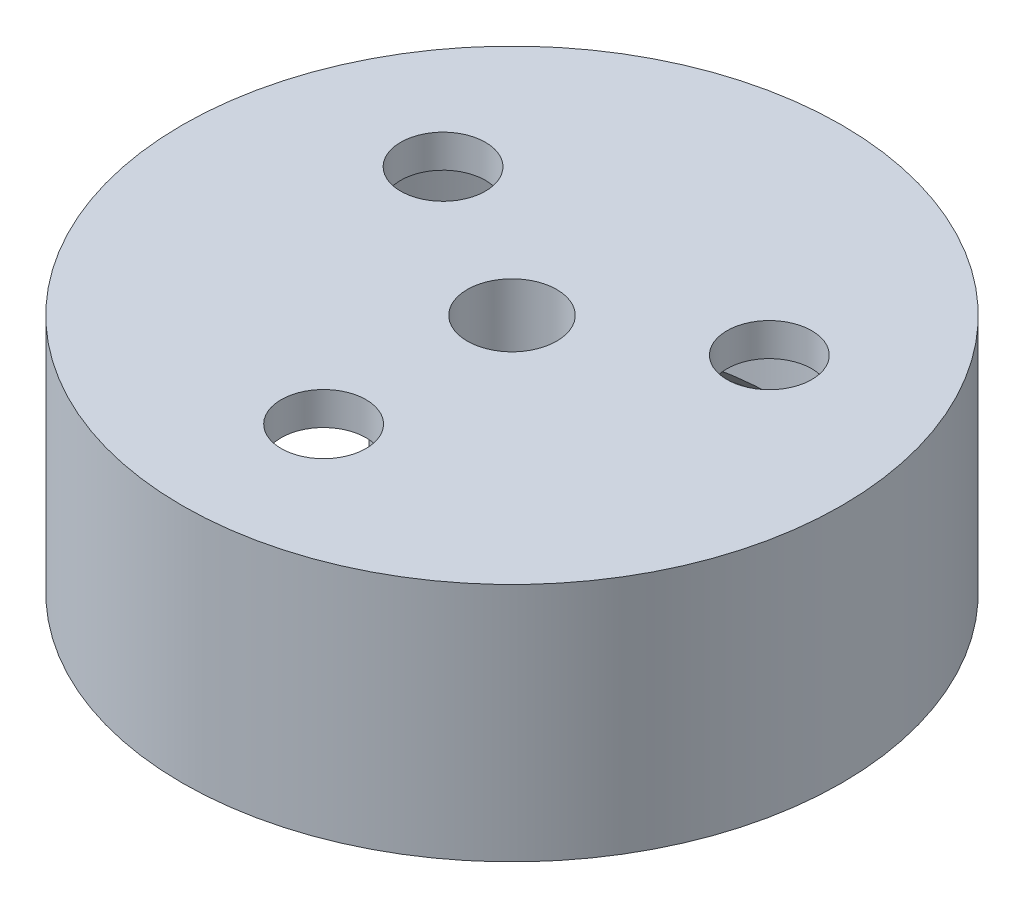
ISO-10303-21;
HEADER;
FILE_DESCRIPTION(('STEP AP214'),'2;1');
FILE_NAME('part.step','',(''),(''),'','','');
FILE_SCHEMA(('AUTOMOTIVE_DESIGN { 1 0 10303 214 1 1 1 1 }'));
ENDSEC;
DATA;
#1=APPLICATION_CONTEXT('core data for automotive mechanical design processes');
#2=APPLICATION_PROTOCOL_DEFINITION('international standard','automotive_design',2000,#1);
#3=PRODUCT_CONTEXT('',#1,'mechanical');
#4=PRODUCT('Part','Part','',(#3));
#5=PRODUCT_RELATED_PRODUCT_CATEGORY('part','',(#4));
#6=PRODUCT_DEFINITION_FORMATION('','',#4);
#7=PRODUCT_DEFINITION_CONTEXT('part definition',#1,'design');
#8=PRODUCT_DEFINITION('design','',#6,#7);
#9=PRODUCT_DEFINITION_SHAPE('','',#8);
#10=(LENGTH_UNIT() NAMED_UNIT(*) SI_UNIT(.MILLI.,.METRE.));
#11=(NAMED_UNIT(*) PLANE_ANGLE_UNIT() SI_UNIT($,.RADIAN.));
#12=(NAMED_UNIT(*) SI_UNIT($,.STERADIAN.) SOLID_ANGLE_UNIT());
#13=UNCERTAINTY_MEASURE_WITH_UNIT(LENGTH_MEASURE(1.E-05),#10,'distance_accuracy_value','');
#14=(GEOMETRIC_REPRESENTATION_CONTEXT(3) GLOBAL_UNCERTAINTY_ASSIGNED_CONTEXT((#13)) GLOBAL_UNIT_ASSIGNED_CONTEXT((#10,
#11,#12)) REPRESENTATION_CONTEXT('',''));
#15=CARTESIAN_POINT('',(0.,0.,0.));
#16=DIRECTION('',(0.,0.,1.));
#17=DIRECTION('',(1.,0.,0.));
#18=AXIS2_PLACEMENT_3D('',#15,#16,#17);
#19=CARTESIAN_POINT('',(0.,0.,0.));
#20=DIRECTION('',(0.,1.,0.));
#21=DIRECTION('',(0.,0.,1.));
#22=AXIS2_PLACEMENT_3D('',#19,#20,#21);
#23=PLANE('',#22);
#24=CARTESIAN_POINT('',(0.,0.,0.));
#25=DIRECTION('',(0.,1.,0.));
#26=DIRECTION('',(0.,0.,1.));
#27=AXIS2_PLACEMENT_3D('',#24,#25,#26);
#28=CIRCLE('',#27,1.35);
#29=CARTESIAN_POINT('',(0.,0.,1.35));
#30=VERTEX_POINT('',#29);
#31=EDGE_CURVE('E193',#30,#30,#28,.F.);
#32=ORIENTED_EDGE('',*,*,#31,.T.);
#33=EDGE_LOOP('',(#32));
#34=FACE_BOUND('',#33,.T.);
#35=CARTESIAN_POINT('',(0.,0.,0.));
#36=DIRECTION('',(0.,-1.,0.));
#37=DIRECTION('',(0.,0.,-1.));
#38=AXIS2_PLACEMENT_3D('',#35,#36,#37);
#39=CIRCLE('',#38,0.95);
#40=CARTESIAN_POINT('',(0.,0.,-0.95));
#41=VERTEX_POINT('',#40);
#42=EDGE_CURVE('E181',#41,#41,#39,.T.);
#43=ORIENTED_EDGE('',*,*,#42,.F.);
#44=EDGE_LOOP('',(#43));
#45=FACE_BOUND('',#44,.T.);
#46=ADVANCED_FACE('F44',(#34,#45),#23,.F.);
#47=CARTESIAN_POINT('',(0.,5.1,0.));
#48=DIRECTION('',(0.,-1.,0.));
#49=DIRECTION('',(0.,0.,-1.));
#50=AXIS2_PLACEMENT_3D('',#47,#48,#49);
#51=CYLINDRICAL_SURFACE('',#50,7.);
#52=CARTESIAN_POINT('',(0.,5.1,0.));
#53=DIRECTION('',(0.,1.,0.));
#54=DIRECTION('',(0.,0.,1.));
#55=AXIS2_PLACEMENT_3D('',#52,#53,#54);
#56=CIRCLE('',#55,7.);
#57=CARTESIAN_POINT('',(0.,5.1,7.));
#58=VERTEX_POINT('',#57);
#59=EDGE_CURVE('E189',#58,#58,#56,.T.);
#60=ORIENTED_EDGE('',*,*,#59,.F.);
#61=EDGE_LOOP('',(#60));
#62=FACE_BOUND('',#61,.T.);
#63=CARTESIAN_POINT('',(0.,0.,0.));
#64=DIRECTION('',(0.,1.,0.));
#65=DIRECTION('',(0.,0.,1.));
#66=AXIS2_PLACEMENT_3D('',#63,#64,#65);
#67=CIRCLE('',#66,7.);
#68=CARTESIAN_POINT('',(0.,0.,7.));
#69=VERTEX_POINT('',#68);
#70=EDGE_CURVE('E188',#69,#69,#67,.T.);
#71=ORIENTED_EDGE('',*,*,#70,.T.);
#72=EDGE_LOOP('',(#71));
#73=FACE_BOUND('',#72,.T.);
#74=ADVANCED_FACE('F319',(#62,#73),#51,.T.);
#75=CARTESIAN_POINT('',(0.,5.1,0.));
#76=DIRECTION('',(0.,1.,0.));
#77=DIRECTION('',(0.,0.,1.));
#78=AXIS2_PLACEMENT_3D('',#75,#76,#77);
#79=PLANE('',#78);
#80=CARTESIAN_POINT('',(0.,5.1,4.));
#81=DIRECTION('',(0.,-1.,0.));
#82=DIRECTION('',(0.,0.,-1.));
#83=AXIS2_PLACEMENT_3D('',#80,#81,#82);
#84=CIRCLE('',#83,0.9);
#85=CARTESIAN_POINT('',(0.,5.1,3.1));
#86=VERTEX_POINT('',#85);
#87=EDGE_CURVE('E248',#86,#86,#84,.T.);
#88=ORIENTED_EDGE('',*,*,#87,.T.);
#89=EDGE_LOOP('',(#88));
#90=FACE_BOUND('',#89,.T.);
#91=CARTESIAN_POINT('',(3.46410161513801,5.1,-1.99999999999985));
#92=DIRECTION('',(0.,-1.,0.));
#93=DIRECTION('',(0.,0.,-1.));
#94=AXIS2_PLACEMENT_3D('',#91,#92,#93);
#95=CIRCLE('',#94,0.900000000000222);
#96=CARTESIAN_POINT('',(3.46410161513801,5.1,-2.90000000000007));
#97=VERTEX_POINT('',#96);
#98=EDGE_CURVE('E290',#97,#97,#95,.T.);
#99=ORIENTED_EDGE('',*,*,#98,.T.);
#100=EDGE_LOOP('',(#99));
#101=FACE_BOUND('',#100,.T.);
#102=CARTESIAN_POINT('',(-3.4641016151375,5.1,-2.00000000000015));
#103=DIRECTION('',(0.,-1.,0.));
#104=DIRECTION('',(0.,0.,-1.));
#105=AXIS2_PLACEMENT_3D('',#102,#103,#104);
#106=CIRCLE('',#105,0.900000000000323);
#107=CARTESIAN_POINT('',(-3.4641016151375,5.1,-2.90000000000047));
#108=VERTEX_POINT('',#107);
#109=EDGE_CURVE('E286',#108,#108,#106,.T.);
#110=ORIENTED_EDGE('',*,*,#109,.T.);
#111=EDGE_LOOP('',(#110));
#112=FACE_BOUND('',#111,.T.);
#113=CARTESIAN_POINT('',(0.,5.1,0.));
#114=DIRECTION('',(0.,1.,0.));
#115=DIRECTION('',(0.,0.,1.));
#116=AXIS2_PLACEMENT_3D('',#113,#114,#115);
#117=CIRCLE('',#116,0.95);
#118=CARTESIAN_POINT('',(0.,5.1,0.95));
#119=VERTEX_POINT('',#118);
#120=EDGE_CURVE('E184',#119,#119,#117,.T.);
#121=ORIENTED_EDGE('',*,*,#120,.F.);
#122=EDGE_LOOP('',(#121));
#123=FACE_BOUND('',#122,.T.);
#124=ORIENTED_EDGE('',*,*,#59,.T.);
#125=EDGE_LOOP('',(#124));
#126=FACE_BOUND('',#125,.T.);
#127=ADVANCED_FACE('F300',(#90,#101,#112,#123,#126),#79,.T.);
#128=DIRECTION('',(0.,0.,1.));
#129=VECTOR('',#128,1.);
#130=CARTESIAN_POINT('',(1.85,0.,6.3));
#131=LINE('',#130,#129);
#132=CARTESIAN_POINT('',(1.85,0.,6.12678545405338));
#133=VERTEX_POINT('',#132);
#134=CARTESIAN_POINT('',(1.85,0.,6.3));
#135=VERTEX_POINT('',#134);
#136=EDGE_CURVE('E143',#133,#135,#131,.T.);
#137=ORIENTED_EDGE('',*,*,#136,.F.);
#138=CARTESIAN_POINT('',(0.,0.,0.));
#139=DIRECTION('',(0.,1.,0.));
#140=DIRECTION('',(0.,0.,1.));
#141=AXIS2_PLACEMENT_3D('',#138,#139,#140);
#142=CIRCLE('',#141,6.40000000000001);
#143=CARTESIAN_POINT('',(-1.85,0.,6.12678545405338));
#144=VERTEX_POINT('',#143);
#145=EDGE_CURVE('E71',#133,#144,#142,.T.);
#146=ORIENTED_EDGE('',*,*,#145,.T.);
#147=DIRECTION('',(0.,0.,-1.));
#148=VECTOR('',#147,1.);
#149=CARTESIAN_POINT('',(-1.85,0.,6.3));
#150=LINE('',#149,#148);
#151=CARTESIAN_POINT('',(-1.85,0.,6.3));
#152=VERTEX_POINT('',#151);
#153=EDGE_CURVE('E153',#152,#144,#150,.T.);
#154=ORIENTED_EDGE('',*,*,#153,.F.);
#155=DIRECTION('',(-1.,0.,0.));
#156=VECTOR('',#155,1.);
#157=CARTESIAN_POINT('',(-1.85,0.,6.3));
#158=LINE('',#157,#156);
#159=EDGE_CURVE('E135',#135,#152,#158,.T.);
#160=ORIENTED_EDGE('',*,*,#159,.F.);
#161=EDGE_LOOP('',(#137,#146,#154,#160));
#162=FACE_BOUND('',#161,.T.);
#163=ORIENTED_EDGE('',*,*,#70,.F.);
#164=EDGE_LOOP('',(#163));
#165=FACE_BOUND('',#164,.T.);
#166=ADVANCED_FACE('F322',(#162,#165),#23,.F.);
#167=CARTESIAN_POINT('',(0.,8.,0.));
#168=DIRECTION('',(0.,-1.,0.));
#169=DIRECTION('',(0.,0.,-1.));
#170=AXIS2_PLACEMENT_3D('',#167,#168,#169);
#171=CYLINDRICAL_SURFACE('',#170,0.95);
#172=ORIENTED_EDGE('',*,*,#120,.T.);
#173=EDGE_LOOP('',(#172));
#174=FACE_BOUND('',#173,.T.);
#175=ORIENTED_EDGE('',*,*,#42,.T.);
#176=EDGE_LOOP('',(#175));
#177=FACE_BOUND('',#176,.T.);
#178=ADVANCED_FACE('F331',(#174,#177),#171,.F.);
#179=CARTESIAN_POINT('',(0.,4.,0.));
#180=DIRECTION('',(0.,-1.,0.));
#181=DIRECTION('',(0.,0.,-1.));
#182=AXIS2_PLACEMENT_3D('',#179,#180,#181);
#183=CYLINDRICAL_SURFACE('',#182,5.6);
#184=DIRECTION('',(0.,-1.,0.));
#185=VECTOR('',#184,1.);
#186=CARTESIAN_POINT('',(-1.05356537528527,4.,5.5));
#187=LINE('',#186,#185);
#188=CARTESIAN_POINT('',(-1.05356537528527,4.,5.5));
#189=VERTEX_POINT('',#188);
#190=CARTESIAN_POINT('',(-1.05356537528527,0.800000000000001,5.5));
#191=VERTEX_POINT('',#190);
#192=EDGE_CURVE('E122',#189,#191,#187,.T.);
#193=ORIENTED_EDGE('',*,*,#192,.T.);
#194=CARTESIAN_POINT('',(0.,0.800000000000001,0.));
#195=DIRECTION('',(0.,1.,0.));
#196=DIRECTION('',(0.,0.,1.));
#197=AXIS2_PLACEMENT_3D('',#194,#195,#196);
#198=CIRCLE('',#197,5.6);
#199=CARTESIAN_POINT('',(1.05356537528527,0.800000000000001,5.5));
#200=VERTEX_POINT('',#199);
#201=EDGE_CURVE('E203',#191,#200,#198,.F.);
#202=ORIENTED_EDGE('',*,*,#201,.T.);
#203=DIRECTION('',(0.,-1.,0.));
#204=VECTOR('',#203,1.);
#205=CARTESIAN_POINT('',(1.05356537528527,4.,5.5));
#206=LINE('',#205,#204);
#207=CARTESIAN_POINT('',(1.05356537528527,4.,5.5));
#208=VERTEX_POINT('',#207);
#209=EDGE_CURVE('E171',#200,#208,#206,.F.);
#210=ORIENTED_EDGE('',*,*,#209,.T.);
#211=CARTESIAN_POINT('',(0.,4.,0.));
#212=DIRECTION('',(0.,-1.,0.));
#213=DIRECTION('',(0.,0.,-1.));
#214=AXIS2_PLACEMENT_3D('',#211,#212,#213);
#215=CIRCLE('',#214,5.6);
#216=EDGE_CURVE('E178',#189,#208,#215,.T.);
#217=ORIENTED_EDGE('',*,*,#216,.F.);
#218=EDGE_LOOP('',(#193,#202,#210,#217));
#219=FACE_BOUND('',#218,.T.);
#220=ADVANCED_FACE('F336',(#219),#183,.F.);
#221=CARTESIAN_POINT('',(0.,4.,0.));
#222=DIRECTION('',(0.,-1.,0.));
#223=DIRECTION('',(0.,0.,-1.));
#224=AXIS2_PLACEMENT_3D('',#221,#222,#223);
#225=PLANE('',#224);
#226=CARTESIAN_POINT('',(0.,4.,4.));
#227=DIRECTION('',(0.,-1.,0.));
#228=DIRECTION('',(0.,0.,-1.));
#229=AXIS2_PLACEMENT_3D('',#226,#227,#228);
#230=CIRCLE('',#229,1.5);
#231=CARTESIAN_POINT('',(0.,4.,2.5));
#232=VERTEX_POINT('',#231);
#233=EDGE_CURVE('E279',#232,#232,#230,.T.);
#234=ORIENTED_EDGE('',*,*,#233,.F.);
#235=EDGE_LOOP('',(#234));
#236=FACE_BOUND('',#235,.T.);
#237=CARTESIAN_POINT('',(3.46410161513801,4.,-1.99999999999985));
#238=DIRECTION('',(0.,-1.,0.));
#239=DIRECTION('',(0.,0.,-1.));
#240=AXIS2_PLACEMENT_3D('',#237,#238,#239);
#241=CIRCLE('',#240,1.50000000000022);
#242=CARTESIAN_POINT('',(3.46410161513801,4.,-3.50000000000007));
#243=VERTEX_POINT('',#242);
#244=EDGE_CURVE('E268',#243,#243,#241,.T.);
#245=ORIENTED_EDGE('',*,*,#244,.F.);
#246=EDGE_LOOP('',(#245));
#247=FACE_BOUND('',#246,.T.);
#248=CARTESIAN_POINT('',(-3.4641016151375,4.,-2.00000000000015));
#249=DIRECTION('',(0.,-1.,0.));
#250=DIRECTION('',(0.,0.,-1.));
#251=AXIS2_PLACEMENT_3D('',#248,#249,#250);
#252=CIRCLE('',#251,1.50000000000032);
#253=CARTESIAN_POINT('',(-3.4641016151375,4.,-3.50000000000047));
#254=VERTEX_POINT('',#253);
#255=EDGE_CURVE('E146',#254,#254,#252,.T.);
#256=ORIENTED_EDGE('',*,*,#255,.F.);
#257=EDGE_LOOP('',(#256));
#258=FACE_BOUND('',#257,.T.);
#259=ORIENTED_EDGE('',*,*,#216,.T.);
#260=DIRECTION('',(1.,0.,0.));
#261=VECTOR('',#260,1.);
#262=CARTESIAN_POINT('',(-1.85,4.,5.5));
#263=LINE('',#262,#261);
#264=CARTESIAN_POINT('',(1.85,4.,5.5));
#265=VERTEX_POINT('',#264);
#266=EDGE_CURVE('E128',#208,#265,#263,.T.);
#267=ORIENTED_EDGE('',*,*,#266,.T.);
#268=DIRECTION('',(0.,0.,1.));
#269=VECTOR('',#268,1.);
#270=CARTESIAN_POINT('',(1.85,4.,6.3));
#271=LINE('',#270,#269);
#272=CARTESIAN_POINT('',(1.85,4.,6.3));
#273=VERTEX_POINT('',#272);
#274=EDGE_CURVE('E127',#265,#273,#271,.T.);
#275=ORIENTED_EDGE('',*,*,#274,.T.);
#276=DIRECTION('',(-1.,0.,0.));
#277=VECTOR('',#276,1.);
#278=CARTESIAN_POINT('',(-1.85,4.,6.3));
#279=LINE('',#278,#277);
#280=CARTESIAN_POINT('',(-1.85,4.,6.3));
#281=VERTEX_POINT('',#280);
#282=EDGE_CURVE('E116',#273,#281,#279,.T.);
#283=ORIENTED_EDGE('',*,*,#282,.T.);
#284=DIRECTION('',(0.,0.,-1.));
#285=VECTOR('',#284,1.);
#286=CARTESIAN_POINT('',(-1.85,4.,6.3));
#287=LINE('',#286,#285);
#288=CARTESIAN_POINT('',(-1.85,4.,5.5));
#289=VERTEX_POINT('',#288);
#290=EDGE_CURVE('E110',#281,#289,#287,.T.);
#291=ORIENTED_EDGE('',*,*,#290,.T.);
#292=EDGE_CURVE('E119',#289,#189,#263,.T.);
#293=ORIENTED_EDGE('',*,*,#292,.T.);
#294=EDGE_LOOP('',(#259,#267,#275,#283,#291,#293));
#295=FACE_BOUND('',#294,.T.);
#296=CARTESIAN_POINT('',(0.,4.,0.));
#297=DIRECTION('',(0.,-1.,0.));
#298=DIRECTION('',(0.,0.,-1.));
#299=AXIS2_PLACEMENT_3D('',#296,#297,#298);
#300=CIRCLE('',#299,2.15);
#301=CARTESIAN_POINT('',(0.,4.,-2.15));
#302=VERTEX_POINT('',#301);
#303=EDGE_CURVE('E174',#302,#302,#300,.T.);
#304=ORIENTED_EDGE('',*,*,#303,.F.);
#305=EDGE_LOOP('',(#304));
#306=FACE_BOUND('',#305,.T.);
#307=ADVANCED_FACE('F130',(#236,#247,#258,#295,#306),#225,.T.);
#308=CARTESIAN_POINT('',(0.,4.,0.));
#309=DIRECTION('',(0.,-1.,0.));
#310=DIRECTION('',(0.,0.,-1.));
#311=AXIS2_PLACEMENT_3D('',#308,#309,#310);
#312=CYLINDRICAL_SURFACE('',#311,2.15);
#313=CARTESIAN_POINT('',(0.,0.800000000000005,0.));
#314=DIRECTION('',(0.,1.,0.));
#315=DIRECTION('',(0.,0.,1.));
#316=AXIS2_PLACEMENT_3D('',#313,#314,#315);
#317=CIRCLE('',#316,2.15);
#318=CARTESIAN_POINT('',(0.,0.800000000000005,2.15));
#319=VERTEX_POINT('',#318);
#320=EDGE_CURVE('E199',#319,#319,#317,.T.);
#321=ORIENTED_EDGE('',*,*,#320,.T.);
#322=EDGE_LOOP('',(#321));
#323=FACE_BOUND('',#322,.T.);
#324=ORIENTED_EDGE('',*,*,#303,.T.);
#325=EDGE_LOOP('',(#324));
#326=FACE_BOUND('',#325,.T.);
#327=ADVANCED_FACE('F226',(#323,#326),#312,.T.);
#328=CARTESIAN_POINT('',(-1.85,4.,5.5));
#329=DIRECTION('',(0.,0.,-1.));
#330=DIRECTION('',(-1.,0.,0.));
#331=AXIS2_PLACEMENT_3D('',#328,#329,#330);
#332=PLANE('',#331);
#333=ORIENTED_EDGE('',*,*,#209,.F.);
#334=CARTESIAN_POINT('',(1.05356537528527,0.800000000000001,5.5));
#335=CARTESIAN_POINT('',(1.12095042340882,0.787324164126497,5.5));
#336=CARTESIAN_POINT('',(1.18811827355289,0.773512442889198,5.5));
#337=CARTESIAN_POINT('',(1.32191171231927,0.743746289491473,5.5));
#338=CARTESIAN_POINT('',(1.38853775183271,0.727793886367867,5.5));
#339=CARTESIAN_POINT('',(1.5212629280321,0.693852102762216,5.5));
#340=CARTESIAN_POINT('',(1.5873620946295,0.675862838810607,5.5));
#341=CARTESIAN_POINT('',(1.71907126000181,0.637949738237488,5.5));
#342=CARTESIAN_POINT('',(1.78468073923725,0.618024094934847,5.5));
#343=CARTESIAN_POINT('',(1.85,0.597198952230056,5.5));
#344=B_SPLINE_CURVE_WITH_KNOTS('',3,(#334,#335,#336,#337,#338,#339,#340,#341,#342,#343),
.UNSPECIFIED.,.F.,.F.,(4,2,2,2,4),(0.,0.205686044840459,0.411178490190537,0.616659185088118,
0.822333472714189),.UNSPECIFIED.);
#345=CARTESIAN_POINT('',(1.85,0.597198952230054,5.5));
#346=VERTEX_POINT('',#345);
#347=EDGE_CURVE('E207',#200,#346,#344,.T.);
#348=ORIENTED_EDGE('',*,*,#347,.T.);
#349=DIRECTION('',(0.,-1.,0.));
#350=VECTOR('',#349,1.);
#351=CARTESIAN_POINT('',(1.85,4.,5.5));
#352=LINE('',#351,#350);
#353=EDGE_CURVE('E115',#265,#346,#352,.T.);
#354=ORIENTED_EDGE('',*,*,#353,.F.);
#355=ORIENTED_EDGE('',*,*,#266,.F.);
#356=EDGE_LOOP('',(#333,#348,#354,#355));
#357=FACE_BOUND('',#356,.T.);
#358=ADVANCED_FACE('F222',(#357),#332,.F.);
#359=DIRECTION('',(0.,-1.,0.));
#360=VECTOR('',#359,1.);
#361=CARTESIAN_POINT('',(-1.85,4.,5.5));
#362=LINE('',#361,#360);
#363=CARTESIAN_POINT('',(-1.85,0.597198952230054,5.5));
#364=VERTEX_POINT('',#363);
#365=EDGE_CURVE('E106',#289,#364,#362,.T.);
#366=ORIENTED_EDGE('',*,*,#365,.T.);
#367=CARTESIAN_POINT('',(-1.85,0.597198952230055,5.5));
#368=CARTESIAN_POINT('',(-1.78468073923725,0.618024094934846,5.5));
#369=CARTESIAN_POINT('',(-1.71907126000181,0.637949738237486,5.5));
#370=CARTESIAN_POINT('',(-1.5873620946295,0.675862838810606,5.5));
#371=CARTESIAN_POINT('',(-1.5212629280321,0.693852102762216,5.5));
#372=CARTESIAN_POINT('',(-1.38853775183272,0.727793886367867,5.5));
#373=CARTESIAN_POINT('',(-1.32191171231927,0.743746289491473,5.5));
#374=CARTESIAN_POINT('',(-1.18811827355289,0.773512442889198,5.5));
#375=CARTESIAN_POINT('',(-1.12095042340882,0.787324164126497,5.5));
#376=CARTESIAN_POINT('',(-1.05356537528527,0.800000000000001,5.5));
#377=B_SPLINE_CURVE_WITH_KNOTS('',3,(#367,#368,#369,#370,#371,#372,#373,#374,#375,#376),
.UNSPECIFIED.,.F.,.F.,(4,2,2,2,4),(0.,0.205674287626071,0.411154982523652,0.61664742787373,
0.822333472714189),.UNSPECIFIED.);
#378=EDGE_CURVE('E11',#364,#191,#377,.T.);
#379=ORIENTED_EDGE('',*,*,#378,.T.);
#380=ORIENTED_EDGE('',*,*,#192,.F.);
#381=ORIENTED_EDGE('',*,*,#292,.F.);
#382=EDGE_LOOP('',(#366,#379,#380,#381));
#383=FACE_BOUND('',#382,.T.);
#384=ADVANCED_FACE('F120',(#383),#332,.F.);
#385=CARTESIAN_POINT('',(-1.85,4.,6.3));
#386=DIRECTION('',(-1.,0.,0.));
#387=DIRECTION('',(0.,0.,1.));
#388=AXIS2_PLACEMENT_3D('',#385,#386,#387);
#389=PLANE('',#388);
#390=ORIENTED_EDGE('',*,*,#153,.T.);
#391=CARTESIAN_POINT('',(-1.85,0.,6.12678545405338));
#392=CARTESIAN_POINT('',(-1.85,0.0997924033278603,6.02256823408604));
#393=CARTESIAN_POINT('',(-1.85,0.199455180603481,5.91822750687696));
#394=CARTESIAN_POINT('',(-1.85,0.398521498052575,5.70929902222973));
#395=CARTESIAN_POINT('',(-1.85,0.497925038186973,5.60471126475435));
#396=CARTESIAN_POINT('',(-1.85,0.597198952230055,5.5));
#397=B_SPLINE_CURVE_WITH_KNOTS('',3,(#391,#392,#393,#394,#395,#396),.UNSPECIFIED.,.F.,.F.,(4,2,
4),(0.,0.432870545035451,0.865741155316185),.UNSPECIFIED.);
#398=EDGE_CURVE('E56',#144,#364,#397,.T.);
#399=ORIENTED_EDGE('',*,*,#398,.T.);
#400=ORIENTED_EDGE('',*,*,#365,.F.);
#401=ORIENTED_EDGE('',*,*,#290,.F.);
#402=DIRECTION('',(0.,-1.,0.));
#403=VECTOR('',#402,1.);
#404=CARTESIAN_POINT('',(-1.85,4.,6.3));
#405=LINE('',#404,#403);
#406=EDGE_CURVE('E159',#281,#152,#405,.T.);
#407=ORIENTED_EDGE('',*,*,#406,.T.);
#408=EDGE_LOOP('',(#390,#399,#400,#401,#407));
#409=FACE_BOUND('',#408,.T.);
#410=ADVANCED_FACE('F108',(#409),#389,.F.);
#411=CARTESIAN_POINT('',(-1.85,4.,6.3));
#412=DIRECTION('',(0.,0.,1.));
#413=DIRECTION('',(1.,0.,0.));
#414=AXIS2_PLACEMENT_3D('',#411,#412,#413);
#415=PLANE('',#414);
#416=ORIENTED_EDGE('',*,*,#159,.T.);
#417=ORIENTED_EDGE('',*,*,#406,.F.);
#418=ORIENTED_EDGE('',*,*,#282,.F.);
#419=DIRECTION('',(0.,-1.,0.));
#420=VECTOR('',#419,1.);
#421=CARTESIAN_POINT('',(1.85,4.,6.3));
#422=LINE('',#421,#420);
#423=EDGE_CURVE('E162',#273,#135,#422,.T.);
#424=ORIENTED_EDGE('',*,*,#423,.T.);
#425=EDGE_LOOP('',(#416,#417,#418,#424));
#426=FACE_BOUND('',#425,.T.);
#427=ADVANCED_FACE('F357',(#426),#415,.F.);
#428=CARTESIAN_POINT('',(1.85,4.,6.3));
#429=DIRECTION('',(1.,0.,0.));
#430=DIRECTION('',(0.,0.,-1.));
#431=AXIS2_PLACEMENT_3D('',#428,#429,#430);
#432=PLANE('',#431);
#433=ORIENTED_EDGE('',*,*,#353,.T.);
#434=CARTESIAN_POINT('',(1.85,0.597198952230055,5.5));
#435=CARTESIAN_POINT('',(1.85,0.497925038186973,5.60471126475435));
#436=CARTESIAN_POINT('',(1.85,0.398521498052575,5.70929902222973));
#437=CARTESIAN_POINT('',(1.85,0.199455180603481,5.91822750687696));
#438=CARTESIAN_POINT('',(1.85,0.0997924033278605,6.02256823408604));
#439=CARTESIAN_POINT('',(1.85,0.,6.12678545405338));
#440=B_SPLINE_CURVE_WITH_KNOTS('',3,(#434,#435,#436,#437,#438,#439),.UNSPECIFIED.,.F.,.F.,(4,2,
4),(0.,0.432870610280734,0.865741155316184),.UNSPECIFIED.);
#441=EDGE_CURVE('E215',#346,#133,#440,.T.);
#442=ORIENTED_EDGE('',*,*,#441,.T.);
#443=ORIENTED_EDGE('',*,*,#136,.T.);
#444=ORIENTED_EDGE('',*,*,#423,.F.);
#445=ORIENTED_EDGE('',*,*,#274,.F.);
#446=EDGE_LOOP('',(#433,#442,#443,#444,#445));
#447=FACE_BOUND('',#446,.T.);
#448=ADVANCED_FACE('F228',(#447),#432,.F.);
#449=CARTESIAN_POINT('',(0.,0.,0.));
#450=DIRECTION('',(0.,1.,0.));
#451=DIRECTION('',(0.,0.,1.));
#452=AXIS2_PLACEMENT_3D('',#449,#450,#451);
#453=CONICAL_SURFACE('',#452,1.35,0.785398163397447);
#454=ORIENTED_EDGE('',*,*,#320,.F.);
#455=EDGE_LOOP('',(#454));
#456=FACE_BOUND('',#455,.T.);
#457=ORIENTED_EDGE('',*,*,#31,.F.);
#458=EDGE_LOOP('',(#457));
#459=FACE_BOUND('',#458,.T.);
#460=ADVANCED_FACE('F363',(#456,#459),#453,.T.);
#461=CARTESIAN_POINT('',(0.,0.800000000000001,0.));
#462=DIRECTION('',(0.,-1.,0.));
#463=DIRECTION('',(0.,0.,-1.));
#464=AXIS2_PLACEMENT_3D('',#461,#462,#463);
#465=CONICAL_SURFACE('',#464,5.6,0.785398163397451);
#466=ORIENTED_EDGE('',*,*,#398,.F.);
#467=ORIENTED_EDGE('',*,*,#145,.F.);
#468=ORIENTED_EDGE('',*,*,#441,.F.);
#469=ORIENTED_EDGE('',*,*,#347,.F.);
#470=ORIENTED_EDGE('',*,*,#201,.F.);
#471=ORIENTED_EDGE('',*,*,#378,.F.);
#472=EDGE_LOOP('',(#466,#467,#468,#469,#470,#471));
#473=FACE_BOUND('',#472,.T.);
#474=ADVANCED_FACE('F47',(#473),#465,.F.);
#475=CARTESIAN_POINT('',(-3.4641016151375,4.4,-2.00000000000015));
#476=DIRECTION('',(0.,-1.,0.));
#477=DIRECTION('',(0.,0.,-1.));
#478=AXIS2_PLACEMENT_3D('',#475,#476,#477);
#479=CYLINDRICAL_SURFACE('',#478,1.50000000000032);
#480=CARTESIAN_POINT('',(-3.4641016151375,4.4,-2.00000000000015));
#481=DIRECTION('',(0.,-1.,0.));
#482=DIRECTION('',(0.,0.,-1.));
#483=AXIS2_PLACEMENT_3D('',#480,#481,#482);
#484=CIRCLE('',#483,1.50000000000032);
#485=CARTESIAN_POINT('',(-3.4641016151375,4.4,-3.50000000000047));
#486=VERTEX_POINT('',#485);
#487=EDGE_CURVE('E261',#486,#486,#484,.T.);
#488=ORIENTED_EDGE('',*,*,#487,.F.);
#489=EDGE_LOOP('',(#488));
#490=FACE_BOUND('',#489,.T.);
#491=ORIENTED_EDGE('',*,*,#255,.T.);
#492=EDGE_LOOP('',(#491));
#493=FACE_BOUND('',#492,.T.);
#494=ADVANCED_FACE('F365',(#490,#493),#479,.F.);
#495=CARTESIAN_POINT('',(-3.4641016151375,4.4,-2.00000000000015));
#496=DIRECTION('',(0.,-1.,0.));
#497=DIRECTION('',(0.,0.,-1.));
#498=AXIS2_PLACEMENT_3D('',#495,#496,#497);
#499=PLANE('',#498);
#500=CARTESIAN_POINT('',(-3.4641016151375,4.4,-2.00000000000015));
#501=DIRECTION('',(0.,-1.,0.));
#502=DIRECTION('',(0.,0.,-1.));
#503=AXIS2_PLACEMENT_3D('',#500,#501,#502);
#504=CIRCLE('',#503,0.900000000000323);
#505=CARTESIAN_POINT('',(-3.4641016151375,4.4,-2.90000000000047));
#506=VERTEX_POINT('',#505);
#507=EDGE_CURVE('E50',#506,#506,#504,.T.);
#508=ORIENTED_EDGE('',*,*,#507,.F.);
#509=EDGE_LOOP('',(#508));
#510=FACE_BOUND('',#509,.T.);
#511=ORIENTED_EDGE('',*,*,#487,.T.);
#512=EDGE_LOOP('',(#511));
#513=FACE_BOUND('',#512,.T.);
#514=ADVANCED_FACE('F368',(#510,#513),#499,.T.);
#515=CARTESIAN_POINT('',(3.46410161513801,4.4,-1.99999999999985));
#516=DIRECTION('',(0.,-1.,0.));
#517=DIRECTION('',(0.,0.,-1.));
#518=AXIS2_PLACEMENT_3D('',#515,#516,#517);
#519=CYLINDRICAL_SURFACE('',#518,1.50000000000022);
#520=CARTESIAN_POINT('',(3.46410161513801,4.4,-1.99999999999985));
#521=DIRECTION('',(0.,-1.,0.));
#522=DIRECTION('',(0.,0.,-1.));
#523=AXIS2_PLACEMENT_3D('',#520,#521,#522);
#524=CIRCLE('',#523,1.50000000000022);
#525=CARTESIAN_POINT('',(3.46410161513801,4.4,-3.50000000000007));
#526=VERTEX_POINT('',#525);
#527=EDGE_CURVE('E273',#526,#526,#524,.T.);
#528=ORIENTED_EDGE('',*,*,#527,.F.);
#529=EDGE_LOOP('',(#528));
#530=FACE_BOUND('',#529,.T.);
#531=ORIENTED_EDGE('',*,*,#244,.T.);
#532=EDGE_LOOP('',(#531));
#533=FACE_BOUND('',#532,.T.);
#534=ADVANCED_FACE('F372',(#530,#533),#519,.F.);
#535=CARTESIAN_POINT('',(3.46410161513801,4.4,-1.99999999999985));
#536=DIRECTION('',(0.,-1.,0.));
#537=DIRECTION('',(0.,0.,-1.));
#538=AXIS2_PLACEMENT_3D('',#535,#536,#537);
#539=PLANE('',#538);
#540=CARTESIAN_POINT('',(3.46410161513801,4.4,-1.99999999999985));
#541=DIRECTION('',(0.,-1.,0.));
#542=DIRECTION('',(0.,0.,-1.));
#543=AXIS2_PLACEMENT_3D('',#540,#541,#542);
#544=CIRCLE('',#543,0.900000000000222);
#545=CARTESIAN_POINT('',(3.46410161513801,4.4,-2.90000000000007));
#546=VERTEX_POINT('',#545);
#547=EDGE_CURVE('E247',#546,#546,#544,.T.);
#548=ORIENTED_EDGE('',*,*,#547,.F.);
#549=EDGE_LOOP('',(#548));
#550=FACE_BOUND('',#549,.T.);
#551=ORIENTED_EDGE('',*,*,#527,.T.);
#552=EDGE_LOOP('',(#551));
#553=FACE_BOUND('',#552,.T.);
#554=ADVANCED_FACE('F376',(#550,#553),#539,.T.);
#555=CARTESIAN_POINT('',(0.,4.4,4.));
#556=DIRECTION('',(0.,-1.,0.));
#557=DIRECTION('',(0.,0.,-1.));
#558=AXIS2_PLACEMENT_3D('',#555,#556,#557);
#559=CYLINDRICAL_SURFACE('',#558,1.5);
#560=CARTESIAN_POINT('',(0.,4.4,4.));
#561=DIRECTION('',(0.,-1.,0.));
#562=DIRECTION('',(0.,0.,-1.));
#563=AXIS2_PLACEMENT_3D('',#560,#561,#562);
#564=CIRCLE('',#563,1.5);
#565=CARTESIAN_POINT('',(0.,4.4,2.5));
#566=VERTEX_POINT('',#565);
#567=EDGE_CURVE('E156',#566,#566,#564,.T.);
#568=ORIENTED_EDGE('',*,*,#567,.F.);
#569=EDGE_LOOP('',(#568));
#570=FACE_BOUND('',#569,.T.);
#571=ORIENTED_EDGE('',*,*,#233,.T.);
#572=EDGE_LOOP('',(#571));
#573=FACE_BOUND('',#572,.T.);
#574=ADVANCED_FACE('F315',(#570,#573),#559,.F.);
#575=CARTESIAN_POINT('',(0.,4.4,4.));
#576=DIRECTION('',(0.,-1.,0.));
#577=DIRECTION('',(0.,0.,-1.));
#578=AXIS2_PLACEMENT_3D('',#575,#576,#577);
#579=PLANE('',#578);
#580=CARTESIAN_POINT('',(0.,4.4,4.));
#581=DIRECTION('',(0.,-1.,0.));
#582=DIRECTION('',(0.,0.,-1.));
#583=AXIS2_PLACEMENT_3D('',#580,#581,#582);
#584=CIRCLE('',#583,0.9);
#585=CARTESIAN_POINT('',(0.,4.4,3.1));
#586=VERTEX_POINT('',#585);
#587=EDGE_CURVE('E244',#586,#586,#584,.T.);
#588=ORIENTED_EDGE('',*,*,#587,.F.);
#589=EDGE_LOOP('',(#588));
#590=FACE_BOUND('',#589,.T.);
#591=ORIENTED_EDGE('',*,*,#567,.T.);
#592=EDGE_LOOP('',(#591));
#593=FACE_BOUND('',#592,.T.);
#594=ADVANCED_FACE('F306',(#590,#593),#579,.T.);
#595=CARTESIAN_POINT('',(0.,5.1,4.));
#596=DIRECTION('',(0.,-1.,0.));
#597=DIRECTION('',(0.,0.,-1.));
#598=AXIS2_PLACEMENT_3D('',#595,#596,#597);
#599=CYLINDRICAL_SURFACE('',#598,0.9);
#600=ORIENTED_EDGE('',*,*,#587,.T.);
#601=EDGE_LOOP('',(#600));
#602=FACE_BOUND('',#601,.T.);
#603=ORIENTED_EDGE('',*,*,#87,.F.);
#604=EDGE_LOOP('',(#603));
#605=FACE_BOUND('',#604,.T.);
#606=ADVANCED_FACE('F303',(#602,#605),#599,.F.);
#607=CARTESIAN_POINT('',(3.46410161513801,5.1,-1.99999999999985));
#608=DIRECTION('',(0.,-1.,0.));
#609=DIRECTION('',(0.,0.,-1.));
#610=AXIS2_PLACEMENT_3D('',#607,#608,#609);
#611=CYLINDRICAL_SURFACE('',#610,0.900000000000222);
#612=ORIENTED_EDGE('',*,*,#547,.T.);
#613=EDGE_LOOP('',(#612));
#614=FACE_BOUND('',#613,.T.);
#615=ORIENTED_EDGE('',*,*,#98,.F.);
#616=EDGE_LOOP('',(#615));
#617=FACE_BOUND('',#616,.T.);
#618=ADVANCED_FACE('F305',(#614,#617),#611,.F.);
#619=CARTESIAN_POINT('',(-3.4641016151375,5.1,-2.00000000000015));
#620=DIRECTION('',(0.,-1.,0.));
#621=DIRECTION('',(0.,0.,-1.));
#622=AXIS2_PLACEMENT_3D('',#619,#620,#621);
#623=CYLINDRICAL_SURFACE('',#622,0.900000000000323);
#624=ORIENTED_EDGE('',*,*,#507,.T.);
#625=EDGE_LOOP('',(#624));
#626=FACE_BOUND('',#625,.T.);
#627=ORIENTED_EDGE('',*,*,#109,.F.);
#628=EDGE_LOOP('',(#627));
#629=FACE_BOUND('',#628,.T.);
#630=ADVANCED_FACE('F313',(#626,#629),#623,.F.);
#631=CLOSED_SHELL('',(#46,#74,#127,#166,#178,#220,#307,#327,#358,#384,#410,#427,#448,#460,#474,
#494,#514,#534,#554,#574,#594,#606,#618,#630));
#632=MANIFOLD_SOLID_BREP('B2',#631);
#633=ADVANCED_BREP_SHAPE_REPRESENTATION('',(#18,#632),#14);
#634=SHAPE_DEFINITION_REPRESENTATION(#9,#633);
ENDSEC;
END-ISO-10303-21;
